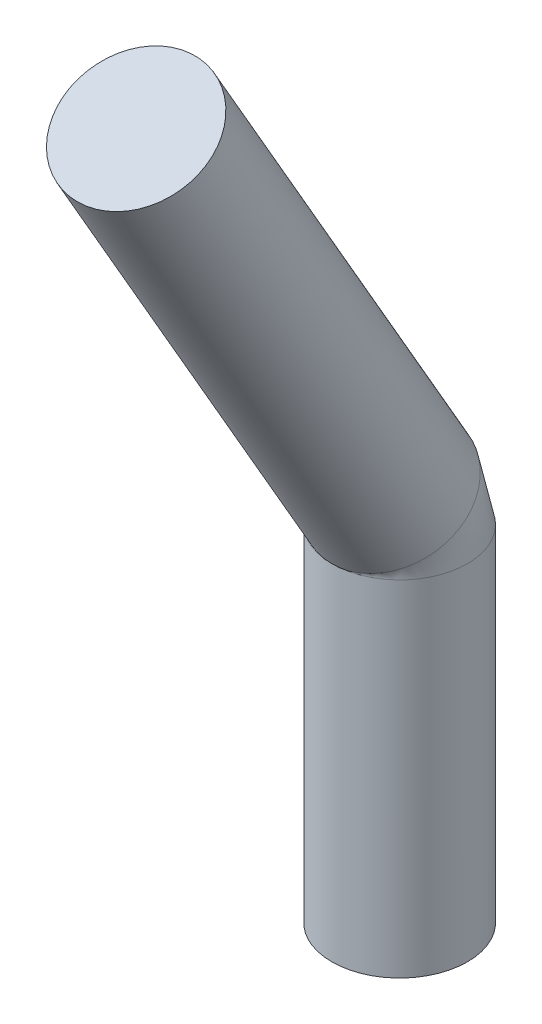
ISO-10303-21;
HEADER;
FILE_DESCRIPTION(('STEP AP214'),'2;1');
FILE_NAME('part.step','',(''),(''),'','','');
FILE_SCHEMA(('AUTOMOTIVE_DESIGN { 1 0 10303 214 1 1 1 1 }'));
ENDSEC;
DATA;
#1=APPLICATION_CONTEXT('core data for automotive mechanical design processes');
#2=APPLICATION_PROTOCOL_DEFINITION('international standard','automotive_design',2000,#1);
#3=PRODUCT_CONTEXT('',#1,'mechanical');
#4=PRODUCT('Part','Part','',(#3));
#5=PRODUCT_RELATED_PRODUCT_CATEGORY('part','',(#4));
#6=PRODUCT_DEFINITION_FORMATION('','',#4);
#7=PRODUCT_DEFINITION_CONTEXT('part definition',#1,'design');
#8=PRODUCT_DEFINITION('design','',#6,#7);
#9=PRODUCT_DEFINITION_SHAPE('','',#8);
#10=(LENGTH_UNIT() NAMED_UNIT(*) SI_UNIT(.MILLI.,.METRE.));
#11=(NAMED_UNIT(*) PLANE_ANGLE_UNIT() SI_UNIT($,.RADIAN.));
#12=(NAMED_UNIT(*) SI_UNIT($,.STERADIAN.) SOLID_ANGLE_UNIT());
#13=UNCERTAINTY_MEASURE_WITH_UNIT(LENGTH_MEASURE(1.E-05),#10,'distance_accuracy_value','');
#14=(GEOMETRIC_REPRESENTATION_CONTEXT(3) GLOBAL_UNCERTAINTY_ASSIGNED_CONTEXT((#13)) GLOBAL_UNIT_ASSIGNED_CONTEXT((#10,
#11,#12)) REPRESENTATION_CONTEXT('',''));
#15=CARTESIAN_POINT('',(0.,0.,0.));
#16=DIRECTION('',(0.,0.,1.));
#17=DIRECTION('',(1.,0.,0.));
#18=AXIS2_PLACEMENT_3D('',#15,#16,#17);
#19=CARTESIAN_POINT('',(0.,4.69711431702997,2.33038475772934));
#20=DIRECTION('',(0.,0.866025403784438,0.500000000000001));
#21=DIRECTION('',(0.,-0.500000000000001,0.866025403784438));
#22=AXIS2_PLACEMENT_3D('',#19,#20,#21);
#23=PLANE('',#22);
#24=CARTESIAN_POINT('',(0.,4.69711431702997,2.33038475772934));
#25=DIRECTION('',(0.,0.866025403784438,0.500000000000001));
#26=DIRECTION('',(0.,-0.500000000000001,0.866025403784438));
#27=AXIS2_PLACEMENT_3D('',#24,#25,#26);
#28=CIRCLE('',#27,0.6);
#29=CARTESIAN_POINT('',(0.,4.39711431702997,2.85000000000001));
#30=VERTEX_POINT('',#29);
#31=EDGE_CURVE('E11',#30,#30,#28,.T.);
#32=ORIENTED_EDGE('',*,*,#31,.T.);
#33=EDGE_LOOP('',(#32));
#34=FACE_BOUND('',#33,.T.);
#35=ADVANCED_FACE('F38',(#34),#23,.T.);
#36=CARTESIAN_POINT('',(0.,0.,0.));
#37=DIRECTION('',(0.,1.,0.));
#38=DIRECTION('',(0.,0.,1.));
#39=AXIS2_PLACEMENT_3D('',#36,#37,#38);
#40=CYLINDRICAL_SURFACE('',#39,0.6);
#41=CARTESIAN_POINT('',(0.,0.5,0.));
#42=DIRECTION('',(0.,1.,0.));
#43=DIRECTION('',(0.,0.,1.));
#44=AXIS2_PLACEMENT_3D('',#41,#42,#43);
#45=CIRCLE('',#44,0.6);
#46=CARTESIAN_POINT('',(0.,0.5,0.6));
#47=VERTEX_POINT('',#46);
#48=EDGE_CURVE('E49',#47,#47,#45,.T.);
#49=ORIENTED_EDGE('',*,*,#48,.F.);
#50=EDGE_LOOP('',(#49));
#51=FACE_BOUND('',#50,.T.);
#52=CARTESIAN_POINT('',(0.,-2.55,0.));
#53=DIRECTION('',(0.,-1.,0.));
#54=DIRECTION('',(0.,0.,-1.));
#55=AXIS2_PLACEMENT_3D('',#52,#53,#54);
#56=CIRCLE('',#55,0.6);
#57=CARTESIAN_POINT('',(0.,-2.55,-0.6));
#58=VERTEX_POINT('',#57);
#59=EDGE_CURVE('E56',#58,#58,#56,.T.);
#60=ORIENTED_EDGE('',*,*,#59,.F.);
#61=EDGE_LOOP('',(#60));
#62=FACE_BOUND('',#61,.T.);
#63=ADVANCED_FACE('F50',(#51,#62),#40,.T.);
#64=CARTESIAN_POINT('',(0.,0.5,0.6));
#65=DIRECTION('',(1.,0.,0.));
#66=DIRECTION('',(0.,0.,-1.));
#67=AXIS2_PLACEMENT_3D('',#64,#65,#66);
#68=DEGENERATE_TOROIDAL_SURFACE('',#67,0.6,0.6,.T.);
#69=CARTESIAN_POINT('',(0.,0.800000000000001,0.0803847577293372));
#70=DIRECTION('',(0.,0.866025403784438,0.500000000000001));
#71=DIRECTION('',(0.,-0.500000000000001,0.866025403784438));
#72=AXIS2_PLACEMENT_3D('',#69,#70,#71);
#73=CIRCLE('',#72,0.6);
#74=EDGE_CURVE('E45',#47,#47,#73,.T.);
#75=ORIENTED_EDGE('',*,*,#74,.F.);
#76=ORIENTED_EDGE('',*,*,#48,.T.);
#77=EDGE_LOOP('',(#75,#76));
#78=FACE_BOUND('',#77,.T.);
#79=ADVANCED_FACE('F66',(#78),#68,.T.);
#80=CARTESIAN_POINT('',(0.,0.800000000000001,0.0803847577293372));
#81=DIRECTION('',(0.,0.866025403784438,0.500000000000001));
#82=DIRECTION('',(0.,-0.500000000000001,0.866025403784438));
#83=AXIS2_PLACEMENT_3D('',#80,#81,#82);
#84=CYLINDRICAL_SURFACE('',#83,0.6);
#85=ORIENTED_EDGE('',*,*,#31,.F.);
#86=EDGE_LOOP('',(#85));
#87=FACE_BOUND('',#86,.T.);
#88=ORIENTED_EDGE('',*,*,#74,.T.);
#89=EDGE_LOOP('',(#88));
#90=FACE_BOUND('',#89,.T.);
#91=ADVANCED_FACE('F72',(#87,#90),#84,.T.);
#92=CARTESIAN_POINT('',(0.,-2.55,0.));
#93=DIRECTION('',(0.,-1.,0.));
#94=DIRECTION('',(0.,0.,-1.));
#95=AXIS2_PLACEMENT_3D('',#92,#93,#94);
#96=PLANE('',#95);
#97=ORIENTED_EDGE('',*,*,#59,.T.);
#98=EDGE_LOOP('',(#97));
#99=FACE_BOUND('',#98,.T.);
#100=ADVANCED_FACE('F64',(#99),#96,.T.);
#101=CLOSED_SHELL('',(#35,#63,#79,#91,#100));
#102=MANIFOLD_SOLID_BREP('B2',#101);
#103=ADVANCED_BREP_SHAPE_REPRESENTATION('',(#18,#102),#14);
#104=SHAPE_DEFINITION_REPRESENTATION(#9,#103);
ENDSEC;
END-ISO-10303-21;
